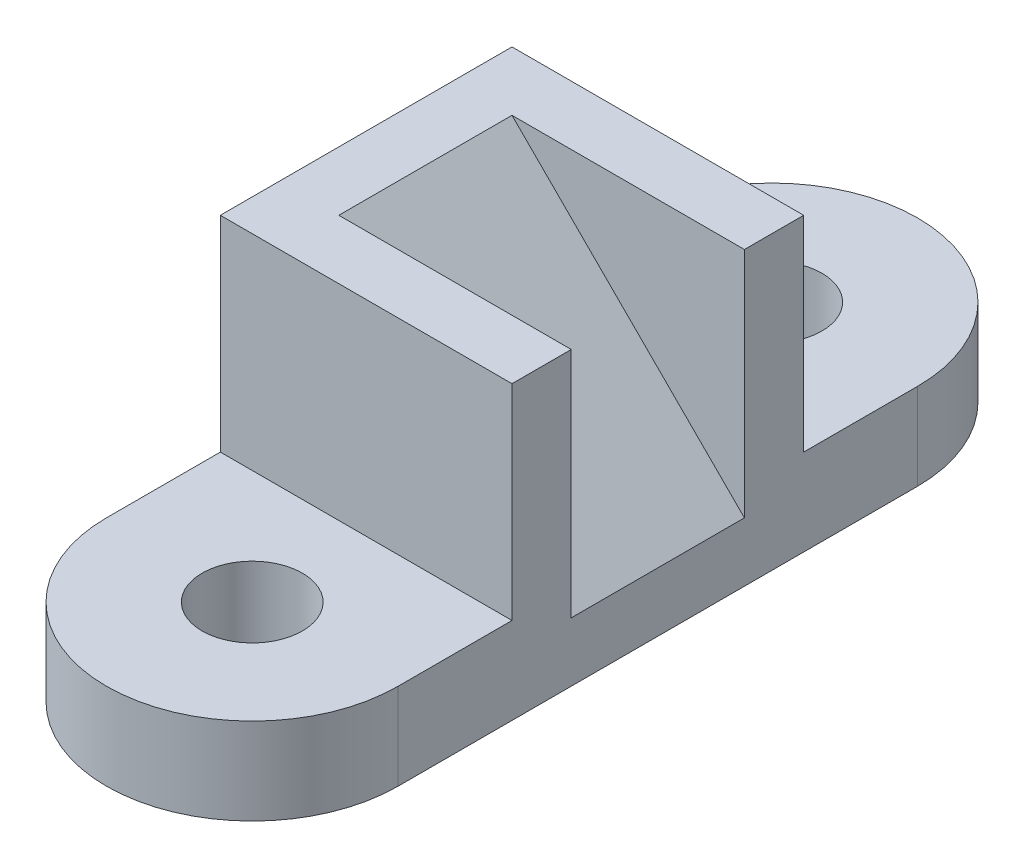
ISO-10303-21;
HEADER;
FILE_DESCRIPTION(('STEP AP214'),'2;1');
FILE_NAME('part.step','',(''),(''),'','','');
FILE_SCHEMA(('AUTOMOTIVE_DESIGN { 1 0 10303 214 1 1 1 1 }'));
ENDSEC;
DATA;
#1=APPLICATION_CONTEXT('core data for automotive mechanical design processes');
#2=APPLICATION_PROTOCOL_DEFINITION('international standard','automotive_design',2000,#1);
#3=PRODUCT_CONTEXT('',#1,'mechanical');
#4=PRODUCT('Part','Part','',(#3));
#5=PRODUCT_RELATED_PRODUCT_CATEGORY('part','',(#4));
#6=PRODUCT_DEFINITION_FORMATION('','',#4);
#7=PRODUCT_DEFINITION_CONTEXT('part definition',#1,'design');
#8=PRODUCT_DEFINITION('design','',#6,#7);
#9=PRODUCT_DEFINITION_SHAPE('','',#8);
#10=(LENGTH_UNIT() NAMED_UNIT(*) SI_UNIT(.MILLI.,.METRE.));
#11=(NAMED_UNIT(*) PLANE_ANGLE_UNIT() SI_UNIT($,.RADIAN.));
#12=(NAMED_UNIT(*) SI_UNIT($,.STERADIAN.) SOLID_ANGLE_UNIT());
#13=UNCERTAINTY_MEASURE_WITH_UNIT(LENGTH_MEASURE(1.E-05),#10,'distance_accuracy_value','');
#14=(GEOMETRIC_REPRESENTATION_CONTEXT(3) GLOBAL_UNCERTAINTY_ASSIGNED_CONTEXT((#13)) GLOBAL_UNIT_ASSIGNED_CONTEXT((#10,
#11,#12)) REPRESENTATION_CONTEXT('',''));
#15=CARTESIAN_POINT('',(0.,0.,0.));
#16=DIRECTION('',(0.,0.,1.));
#17=DIRECTION('',(1.,0.,0.));
#18=AXIS2_PLACEMENT_3D('',#15,#16,#17);
#19=CARTESIAN_POINT('',(-19.,64.,19.));
#20=DIRECTION('',(0.,0.,1.));
#21=DIRECTION('',(1.,0.,0.));
#22=AXIS2_PLACEMENT_3D('',#19,#20,#21);
#23=PLANE('',#22);
#24=DIRECTION('',(-0.707106781186548,0.707106781186547,0.));
#25=VECTOR('',#24,1.);
#26=CARTESIAN_POINT('',(-19.,64.,19.));
#27=LINE('',#26,#25);
#28=CARTESIAN_POINT('',(32.,13.,19.));
#29=VERTEX_POINT('',#28);
#30=CARTESIAN_POINT('',(-19.,64.,19.));
#31=VERTEX_POINT('',#30);
#32=EDGE_CURVE('E137',#29,#31,#27,.T.);
#33=ORIENTED_EDGE('',*,*,#32,.T.);
#34=DIRECTION('',(-1.,0.,0.));
#35=VECTOR('',#34,1.);
#36=CARTESIAN_POINT('',(-19.,64.,19.));
#37=LINE('',#36,#35);
#38=CARTESIAN_POINT('',(32.,64.,19.));
#39=VERTEX_POINT('',#38);
#40=EDGE_CURVE('E154',#39,#31,#37,.T.);
#41=ORIENTED_EDGE('',*,*,#40,.F.);
#42=DIRECTION('',(0.,-1.,0.));
#43=VECTOR('',#42,1.);
#44=CARTESIAN_POINT('',(32.,64.,19.));
#45=LINE('',#44,#43);
#46=EDGE_CURVE('E129',#39,#29,#45,.T.);
#47=ORIENTED_EDGE('',*,*,#46,.T.);
#48=EDGE_LOOP('',(#33,#41,#47));
#49=FACE_BOUND('',#48,.T.);
#50=ADVANCED_FACE('F33',(#49),#23,.F.);
#51=CARTESIAN_POINT('',(32.,64.,-19.));
#52=DIRECTION('',(0.,0.,-1.));
#53=DIRECTION('',(-1.,0.,0.));
#54=AXIS2_PLACEMENT_3D('',#51,#52,#53);
#55=PLANE('',#54);
#56=DIRECTION('',(-0.707106781186548,0.707106781186547,0.));
#57=VECTOR('',#56,1.);
#58=CARTESIAN_POINT('',(-19.,64.,-19.));
#59=LINE('',#58,#57);
#60=CARTESIAN_POINT('',(32.,13.,-19.));
#61=VERTEX_POINT('',#60);
#62=CARTESIAN_POINT('',(-19.,64.,-19.));
#63=VERTEX_POINT('',#62);
#64=EDGE_CURVE('E133',#61,#63,#59,.T.);
#65=ORIENTED_EDGE('',*,*,#64,.F.);
#66=DIRECTION('',(0.,-1.,0.));
#67=VECTOR('',#66,1.);
#68=CARTESIAN_POINT('',(32.,64.,-19.));
#69=LINE('',#68,#67);
#70=CARTESIAN_POINT('',(32.,64.,-19.));
#71=VERTEX_POINT('',#70);
#72=EDGE_CURVE('E117',#71,#61,#69,.T.);
#73=ORIENTED_EDGE('',*,*,#72,.F.);
#74=DIRECTION('',(1.,0.,0.));
#75=VECTOR('',#74,1.);
#76=CARTESIAN_POINT('',(32.,64.,-19.));
#77=LINE('',#76,#75);
#78=EDGE_CURVE('E130',#63,#71,#77,.T.);
#79=ORIENTED_EDGE('',*,*,#78,.F.);
#80=EDGE_LOOP('',(#65,#73,#79));
#81=FACE_BOUND('',#80,.T.);
#82=ADVANCED_FACE('F134',(#81),#55,.F.);
#83=CARTESIAN_POINT('',(0.,19.,-57.));
#84=DIRECTION('',(0.,1.,0.));
#85=DIRECTION('',(0.,0.,1.));
#86=AXIS2_PLACEMENT_3D('',#83,#84,#85);
#87=PLANE('',#86);
#88=DIRECTION('',(1.,0.,0.));
#89=VECTOR('',#88,1.);
#90=CARTESIAN_POINT('',(-22.4565177830912,19.,32.));
#91=LINE('',#90,#89);
#92=CARTESIAN_POINT('',(-32.,19.,32.));
#93=VERTEX_POINT('',#92);
#94=CARTESIAN_POINT('',(32.,19.,32.));
#95=VERTEX_POINT('',#94);
#96=EDGE_CURVE('E141',#93,#95,#91,.T.);
#97=ORIENTED_EDGE('',*,*,#96,.F.);
#98=DIRECTION('',(0.,0.,1.));
#99=VECTOR('',#98,1.);
#100=CARTESIAN_POINT('',(-32.,19.,-57.));
#101=LINE('',#100,#99);
#102=CARTESIAN_POINT('',(-32.,19.,57.));
#103=VERTEX_POINT('',#102);
#104=EDGE_CURVE('E190',#93,#103,#101,.T.);
#105=ORIENTED_EDGE('',*,*,#104,.T.);
#106=CARTESIAN_POINT('',(0.,19.,57.));
#107=DIRECTION('',(0.,1.,0.));
#108=DIRECTION('',(0.,0.,1.));
#109=AXIS2_PLACEMENT_3D('',#106,#107,#108);
#110=CIRCLE('',#109,32.);
#111=CARTESIAN_POINT('',(32.,19.,57.));
#112=VERTEX_POINT('',#111);
#113=EDGE_CURVE('E194',#103,#112,#110,.T.);
#114=ORIENTED_EDGE('',*,*,#113,.T.);
#115=DIRECTION('',(0.,0.,-1.));
#116=VECTOR('',#115,1.);
#117=CARTESIAN_POINT('',(32.,19.,-57.));
#118=LINE('',#117,#116);
#119=EDGE_CURVE('E56',#112,#95,#118,.T.);
#120=ORIENTED_EDGE('',*,*,#119,.T.);
#121=EDGE_LOOP('',(#97,#105,#114,#120));
#122=FACE_BOUND('',#121,.T.);
#123=CARTESIAN_POINT('',(0.,19.,57.));
#124=DIRECTION('',(0.,1.,0.));
#125=DIRECTION('',(0.,0.,1.));
#126=AXIS2_PLACEMENT_3D('',#123,#124,#125);
#127=CIRCLE('',#126,11.);
#128=CARTESIAN_POINT('',(0.,19.,68.));
#129=VERTEX_POINT('',#128);
#130=EDGE_CURVE('E181',#129,#129,#127,.T.);
#131=ORIENTED_EDGE('',*,*,#130,.F.);
#132=EDGE_LOOP('',(#131));
#133=FACE_BOUND('',#132,.T.);
#134=ADVANCED_FACE('F244',(#122,#133),#87,.T.);
#135=DIRECTION('',(-1.,0.,0.));
#136=VECTOR('',#135,1.);
#137=CARTESIAN_POINT('',(32.,19.,-32.));
#138=LINE('',#137,#136);
#139=CARTESIAN_POINT('',(32.,19.,-32.));
#140=VERTEX_POINT('',#139);
#141=CARTESIAN_POINT('',(-32.,19.,-32.));
#142=VERTEX_POINT('',#141);
#143=EDGE_CURVE('E48',#140,#142,#138,.T.);
#144=ORIENTED_EDGE('',*,*,#143,.F.);
#145=CARTESIAN_POINT('',(32.,19.,-57.));
#146=VERTEX_POINT('',#145);
#147=EDGE_CURVE('E196',#140,#146,#118,.T.);
#148=ORIENTED_EDGE('',*,*,#147,.T.);
#149=CARTESIAN_POINT('',(0.,19.,-57.));
#150=DIRECTION('',(0.,1.,0.));
#151=DIRECTION('',(0.,0.,1.));
#152=AXIS2_PLACEMENT_3D('',#149,#150,#151);
#153=CIRCLE('',#152,32.);
#154=CARTESIAN_POINT('',(-32.,19.,-57.));
#155=VERTEX_POINT('',#154);
#156=EDGE_CURVE('E187',#146,#155,#153,.T.);
#157=ORIENTED_EDGE('',*,*,#156,.T.);
#158=EDGE_CURVE('E192',#155,#142,#101,.T.);
#159=ORIENTED_EDGE('',*,*,#158,.T.);
#160=EDGE_LOOP('',(#144,#148,#157,#159));
#161=FACE_BOUND('',#160,.T.);
#162=CARTESIAN_POINT('',(0.,19.,-57.));
#163=DIRECTION('',(0.,1.,0.));
#164=DIRECTION('',(0.,0.,-1.));
#165=AXIS2_PLACEMENT_3D('',#162,#163,#164);
#166=CIRCLE('',#165,11.);
#167=CARTESIAN_POINT('',(0.,19.,-68.));
#168=VERTEX_POINT('',#167);
#169=EDGE_CURVE('E175',#168,#168,#166,.T.);
#170=ORIENTED_EDGE('',*,*,#169,.F.);
#171=EDGE_LOOP('',(#170));
#172=FACE_BOUND('',#171,.T.);
#173=ADVANCED_FACE('F228',(#161,#172),#87,.T.);
#174=CARTESIAN_POINT('',(0.,0.,-57.));
#175=DIRECTION('',(0.,1.,0.));
#176=DIRECTION('',(0.,0.,1.));
#177=AXIS2_PLACEMENT_3D('',#174,#175,#176);
#178=PLANE('',#177);
#179=CARTESIAN_POINT('',(0.,0.,-57.));
#180=DIRECTION('',(0.,1.,0.));
#181=DIRECTION('',(0.,0.,1.));
#182=AXIS2_PLACEMENT_3D('',#179,#180,#181);
#183=CIRCLE('',#182,32.);
#184=CARTESIAN_POINT('',(32.,0.,-57.));
#185=VERTEX_POINT('',#184);
#186=CARTESIAN_POINT('',(-32.,0.,-57.));
#187=VERTEX_POINT('',#186);
#188=EDGE_CURVE('E184',#185,#187,#183,.T.);
#189=ORIENTED_EDGE('',*,*,#188,.F.);
#190=DIRECTION('',(0.,0.,-1.));
#191=VECTOR('',#190,1.);
#192=CARTESIAN_POINT('',(32.,0.,-57.));
#193=LINE('',#192,#191);
#194=CARTESIAN_POINT('',(32.,0.,57.));
#195=VERTEX_POINT('',#194);
#196=EDGE_CURVE('E191',#195,#185,#193,.T.);
#197=ORIENTED_EDGE('',*,*,#196,.F.);
#198=CARTESIAN_POINT('',(0.,0.,57.));
#199=DIRECTION('',(0.,1.,0.));
#200=DIRECTION('',(0.,0.,1.));
#201=AXIS2_PLACEMENT_3D('',#198,#199,#200);
#202=CIRCLE('',#201,32.);
#203=CARTESIAN_POINT('',(-32.,0.,57.));
#204=VERTEX_POINT('',#203);
#205=EDGE_CURVE('E203',#204,#195,#202,.T.);
#206=ORIENTED_EDGE('',*,*,#205,.F.);
#207=DIRECTION('',(0.,0.,1.));
#208=VECTOR('',#207,1.);
#209=CARTESIAN_POINT('',(-32.,0.,-57.));
#210=LINE('',#209,#208);
#211=EDGE_CURVE('E201',#187,#204,#210,.T.);
#212=ORIENTED_EDGE('',*,*,#211,.F.);
#213=EDGE_LOOP('',(#189,#197,#206,#212));
#214=FACE_BOUND('',#213,.T.);
#215=CARTESIAN_POINT('',(0.,0.,57.));
#216=DIRECTION('',(0.,1.,0.));
#217=DIRECTION('',(0.,0.,1.));
#218=AXIS2_PLACEMENT_3D('',#215,#216,#217);
#219=CIRCLE('',#218,11.);
#220=CARTESIAN_POINT('',(0.,0.,68.));
#221=VERTEX_POINT('',#220);
#222=EDGE_CURVE('E178',#221,#221,#219,.T.);
#223=ORIENTED_EDGE('',*,*,#222,.T.);
#224=EDGE_LOOP('',(#223));
#225=FACE_BOUND('',#224,.T.);
#226=CARTESIAN_POINT('',(0.,0.,-57.));
#227=DIRECTION('',(0.,1.,0.));
#228=DIRECTION('',(0.,0.,-1.));
#229=AXIS2_PLACEMENT_3D('',#226,#227,#228);
#230=CIRCLE('',#229,11.);
#231=CARTESIAN_POINT('',(0.,0.,-68.));
#232=VERTEX_POINT('',#231);
#233=EDGE_CURVE('E174',#232,#232,#230,.T.);
#234=ORIENTED_EDGE('',*,*,#233,.T.);
#235=EDGE_LOOP('',(#234));
#236=FACE_BOUND('',#235,.T.);
#237=ADVANCED_FACE('F222',(#214,#225,#236),#178,.F.);
#238=CARTESIAN_POINT('',(0.,19.,-57.));
#239=DIRECTION('',(0.,-1.,0.));
#240=DIRECTION('',(0.,0.,-1.));
#241=AXIS2_PLACEMENT_3D('',#238,#239,#240);
#242=CYLINDRICAL_SURFACE('',#241,32.);
#243=ORIENTED_EDGE('',*,*,#188,.T.);
#244=DIRECTION('',(0.,-1.,0.));
#245=VECTOR('',#244,1.);
#246=CARTESIAN_POINT('',(-32.,19.,-57.));
#247=LINE('',#246,#245);
#248=EDGE_CURVE('E11',#155,#187,#247,.T.);
#249=ORIENTED_EDGE('',*,*,#248,.F.);
#250=ORIENTED_EDGE('',*,*,#156,.F.);
#251=DIRECTION('',(0.,-1.,0.));
#252=VECTOR('',#251,1.);
#253=CARTESIAN_POINT('',(32.,19.,-57.));
#254=LINE('',#253,#252);
#255=EDGE_CURVE('E198',#146,#185,#254,.T.);
#256=ORIENTED_EDGE('',*,*,#255,.T.);
#257=EDGE_LOOP('',(#243,#249,#250,#256));
#258=FACE_BOUND('',#257,.T.);
#259=ADVANCED_FACE('F35',(#258),#242,.T.);
#260=CARTESIAN_POINT('',(-32.,19.,-57.));
#261=DIRECTION('',(1.,0.,0.));
#262=DIRECTION('',(0.,0.,-1.));
#263=AXIS2_PLACEMENT_3D('',#260,#261,#262);
#264=PLANE('',#263);
#265=ORIENTED_EDGE('',*,*,#211,.T.);
#266=DIRECTION('',(0.,-1.,0.));
#267=VECTOR('',#266,1.);
#268=CARTESIAN_POINT('',(-32.,19.,57.));
#269=LINE('',#268,#267);
#270=EDGE_CURVE('E41',#103,#204,#269,.T.);
#271=ORIENTED_EDGE('',*,*,#270,.F.);
#272=ORIENTED_EDGE('',*,*,#104,.F.);
#273=DIRECTION('',(0.,-1.,0.));
#274=VECTOR('',#273,1.);
#275=CARTESIAN_POINT('',(-32.,64.,32.));
#276=LINE('',#275,#274);
#277=CARTESIAN_POINT('',(-32.,64.,32.));
#278=VERTEX_POINT('',#277);
#279=EDGE_CURVE('E165',#278,#93,#276,.T.);
#280=ORIENTED_EDGE('',*,*,#279,.F.);
#281=DIRECTION('',(0.,0.,1.));
#282=VECTOR('',#281,1.);
#283=CARTESIAN_POINT('',(-32.,64.,-32.));
#284=LINE('',#283,#282);
#285=CARTESIAN_POINT('',(-32.,64.,-32.));
#286=VERTEX_POINT('',#285);
#287=EDGE_CURVE('E148',#286,#278,#284,.T.);
#288=ORIENTED_EDGE('',*,*,#287,.F.);
#289=DIRECTION('',(0.,-1.,0.));
#290=VECTOR('',#289,1.);
#291=CARTESIAN_POINT('',(-32.,64.,-32.));
#292=LINE('',#291,#290);
#293=EDGE_CURVE('E168',#286,#142,#292,.T.);
#294=ORIENTED_EDGE('',*,*,#293,.T.);
#295=ORIENTED_EDGE('',*,*,#158,.F.);
#296=ORIENTED_EDGE('',*,*,#248,.T.);
#297=EDGE_LOOP('',(#265,#271,#272,#280,#288,#294,#295,#296));
#298=FACE_BOUND('',#297,.T.);
#299=ADVANCED_FACE('F246',(#298),#264,.F.);
#300=CARTESIAN_POINT('',(0.,19.,57.));
#301=DIRECTION('',(0.,-1.,0.));
#302=DIRECTION('',(0.,0.,-1.));
#303=AXIS2_PLACEMENT_3D('',#300,#301,#302);
#304=CYLINDRICAL_SURFACE('',#303,32.);
#305=ORIENTED_EDGE('',*,*,#205,.T.);
#306=DIRECTION('',(0.,-1.,0.));
#307=VECTOR('',#306,1.);
#308=CARTESIAN_POINT('',(32.,19.,57.));
#309=LINE('',#308,#307);
#310=EDGE_CURVE('E208',#112,#195,#309,.T.);
#311=ORIENTED_EDGE('',*,*,#310,.F.);
#312=ORIENTED_EDGE('',*,*,#113,.F.);
#313=ORIENTED_EDGE('',*,*,#270,.T.);
#314=EDGE_LOOP('',(#305,#311,#312,#313));
#315=FACE_BOUND('',#314,.T.);
#316=ADVANCED_FACE('F215',(#315),#304,.T.);
#317=CARTESIAN_POINT('',(32.,19.,-57.));
#318=DIRECTION('',(-1.,0.,0.));
#319=DIRECTION('',(0.,0.,1.));
#320=AXIS2_PLACEMENT_3D('',#317,#318,#319);
#321=PLANE('',#320);
#322=DIRECTION('',(0.,0.,-1.));
#323=VECTOR('',#322,1.);
#324=CARTESIAN_POINT('',(32.,13.,19.));
#325=LINE('',#324,#323);
#326=EDGE_CURVE('E122',#29,#61,#325,.T.);
#327=ORIENTED_EDGE('',*,*,#326,.F.);
#328=ORIENTED_EDGE('',*,*,#46,.F.);
#329=DIRECTION('',(0.,0.,-1.));
#330=VECTOR('',#329,1.);
#331=CARTESIAN_POINT('',(32.,64.,32.));
#332=LINE('',#331,#330);
#333=CARTESIAN_POINT('',(32.,64.,32.));
#334=VERTEX_POINT('',#333);
#335=EDGE_CURVE('E152',#334,#39,#332,.T.);
#336=ORIENTED_EDGE('',*,*,#335,.F.);
#337=DIRECTION('',(0.,-1.,0.));
#338=VECTOR('',#337,1.);
#339=CARTESIAN_POINT('',(32.,64.,32.));
#340=LINE('',#339,#338);
#341=EDGE_CURVE('E162',#334,#95,#340,.T.);
#342=ORIENTED_EDGE('',*,*,#341,.T.);
#343=ORIENTED_EDGE('',*,*,#119,.F.);
#344=ORIENTED_EDGE('',*,*,#310,.T.);
#345=ORIENTED_EDGE('',*,*,#196,.T.);
#346=ORIENTED_EDGE('',*,*,#255,.F.);
#347=ORIENTED_EDGE('',*,*,#147,.F.);
#348=DIRECTION('',(0.,-1.,0.));
#349=VECTOR('',#348,1.);
#350=CARTESIAN_POINT('',(32.,64.,-32.));
#351=LINE('',#350,#349);
#352=CARTESIAN_POINT('',(32.,64.,-32.));
#353=VERTEX_POINT('',#352);
#354=EDGE_CURVE('E171',#353,#140,#351,.T.);
#355=ORIENTED_EDGE('',*,*,#354,.F.);
#356=DIRECTION('',(0.,0.,-1.));
#357=VECTOR('',#356,1.);
#358=CARTESIAN_POINT('',(32.,64.,-32.));
#359=LINE('',#358,#357);
#360=EDGE_CURVE('E126',#71,#353,#359,.T.);
#361=ORIENTED_EDGE('',*,*,#360,.F.);
#362=ORIENTED_EDGE('',*,*,#72,.T.);
#363=EDGE_LOOP('',(#327,#328,#336,#342,#343,#344,#345,#346,#347,#355,#361,#362));
#364=FACE_BOUND('',#363,.T.);
#365=ADVANCED_FACE('F119',(#364),#321,.F.);
#366=CARTESIAN_POINT('',(0.,19.,57.));
#367=DIRECTION('',(0.,-1.,0.));
#368=DIRECTION('',(0.,0.,-1.));
#369=AXIS2_PLACEMENT_3D('',#366,#367,#368);
#370=CYLINDRICAL_SURFACE('',#369,11.);
#371=ORIENTED_EDGE('',*,*,#130,.T.);
#372=EDGE_LOOP('',(#371));
#373=FACE_BOUND('',#372,.T.);
#374=ORIENTED_EDGE('',*,*,#222,.F.);
#375=EDGE_LOOP('',(#374));
#376=FACE_BOUND('',#375,.T.);
#377=ADVANCED_FACE('F268',(#373,#376),#370,.F.);
#378=CARTESIAN_POINT('',(0.,19.,-57.));
#379=DIRECTION('',(0.,-1.,0.));
#380=DIRECTION('',(0.,0.,-1.));
#381=AXIS2_PLACEMENT_3D('',#378,#379,#380);
#382=CYLINDRICAL_SURFACE('',#381,11.);
#383=ORIENTED_EDGE('',*,*,#169,.T.);
#384=EDGE_LOOP('',(#383));
#385=FACE_BOUND('',#384,.T.);
#386=ORIENTED_EDGE('',*,*,#233,.F.);
#387=EDGE_LOOP('',(#386));
#388=FACE_BOUND('',#387,.T.);
#389=ADVANCED_FACE('F265',(#385,#388),#382,.F.);
#390=CARTESIAN_POINT('',(32.,64.,-32.));
#391=DIRECTION('',(0.,0.,1.));
#392=DIRECTION('',(1.,0.,0.));
#393=AXIS2_PLACEMENT_3D('',#390,#391,#392);
#394=PLANE('',#393);
#395=ORIENTED_EDGE('',*,*,#143,.T.);
#396=ORIENTED_EDGE('',*,*,#293,.F.);
#397=DIRECTION('',(-1.,0.,0.));
#398=VECTOR('',#397,1.);
#399=CARTESIAN_POINT('',(32.,64.,-32.));
#400=LINE('',#399,#398);
#401=EDGE_CURVE('E146',#353,#286,#400,.T.);
#402=ORIENTED_EDGE('',*,*,#401,.F.);
#403=ORIENTED_EDGE('',*,*,#354,.T.);
#404=EDGE_LOOP('',(#395,#396,#402,#403));
#405=FACE_BOUND('',#404,.T.);
#406=ADVANCED_FACE('F231',(#405),#394,.F.);
#407=CARTESIAN_POINT('',(-22.4565177830912,64.,32.));
#408=DIRECTION('',(0.,0.,-1.));
#409=DIRECTION('',(-1.,0.,0.));
#410=AXIS2_PLACEMENT_3D('',#407,#408,#409);
#411=PLANE('',#410);
#412=ORIENTED_EDGE('',*,*,#96,.T.);
#413=ORIENTED_EDGE('',*,*,#341,.F.);
#414=DIRECTION('',(1.,0.,0.));
#415=VECTOR('',#414,1.);
#416=CARTESIAN_POINT('',(-32.,64.,32.));
#417=LINE('',#416,#415);
#418=EDGE_CURVE('E150',#278,#334,#417,.T.);
#419=ORIENTED_EDGE('',*,*,#418,.F.);
#420=ORIENTED_EDGE('',*,*,#279,.T.);
#421=EDGE_LOOP('',(#412,#413,#419,#420));
#422=FACE_BOUND('',#421,.T.);
#423=ADVANCED_FACE('F242',(#422),#411,.F.);
#424=CARTESIAN_POINT('',(0.,64.,0.));
#425=DIRECTION('',(0.,-1.,0.));
#426=DIRECTION('',(0.,0.,-1.));
#427=AXIS2_PLACEMENT_3D('',#424,#425,#426);
#428=PLANE('',#427);
#429=ORIENTED_EDGE('',*,*,#360,.T.);
#430=ORIENTED_EDGE('',*,*,#401,.T.);
#431=ORIENTED_EDGE('',*,*,#287,.T.);
#432=ORIENTED_EDGE('',*,*,#418,.T.);
#433=ORIENTED_EDGE('',*,*,#335,.T.);
#434=ORIENTED_EDGE('',*,*,#40,.T.);
#435=DIRECTION('',(0.,0.,-1.));
#436=VECTOR('',#435,1.);
#437=CARTESIAN_POINT('',(-19.,64.,-19.));
#438=LINE('',#437,#436);
#439=EDGE_CURVE('E157',#31,#63,#438,.T.);
#440=ORIENTED_EDGE('',*,*,#439,.T.);
#441=ORIENTED_EDGE('',*,*,#78,.T.);
#442=EDGE_LOOP('',(#429,#430,#431,#432,#433,#434,#440,#441));
#443=FACE_BOUND('',#442,.T.);
#444=ADVANCED_FACE('F235',(#443),#428,.F.);
#445=CARTESIAN_POINT('',(-19.,64.,91.1248916810278));
#446=DIRECTION('',(-0.707106781186547,-0.707106781186548,0.));
#447=DIRECTION('',(0.707106781186548,-0.707106781186547,0.));
#448=AXIS2_PLACEMENT_3D('',#445,#446,#447);
#449=PLANE('',#448);
#450=ORIENTED_EDGE('',*,*,#32,.F.);
#451=ORIENTED_EDGE('',*,*,#326,.T.);
#452=ORIENTED_EDGE('',*,*,#64,.T.);
#453=ORIENTED_EDGE('',*,*,#439,.F.);
#454=EDGE_LOOP('',(#450,#451,#452,#453));
#455=FACE_BOUND('',#454,.T.);
#456=ADVANCED_FACE('F139',(#455),#449,.F.);
#457=CLOSED_SHELL('',(#50,#82,#134,#173,#237,#259,#299,#316,#365,#377,#389,#406,#423,#444,#456));
#458=MANIFOLD_SOLID_BREP('B2',#457);
#459=ADVANCED_BREP_SHAPE_REPRESENTATION('',(#18,#458),#14);
#460=SHAPE_DEFINITION_REPRESENTATION(#9,#459);
ENDSEC;
END-ISO-10303-21;
